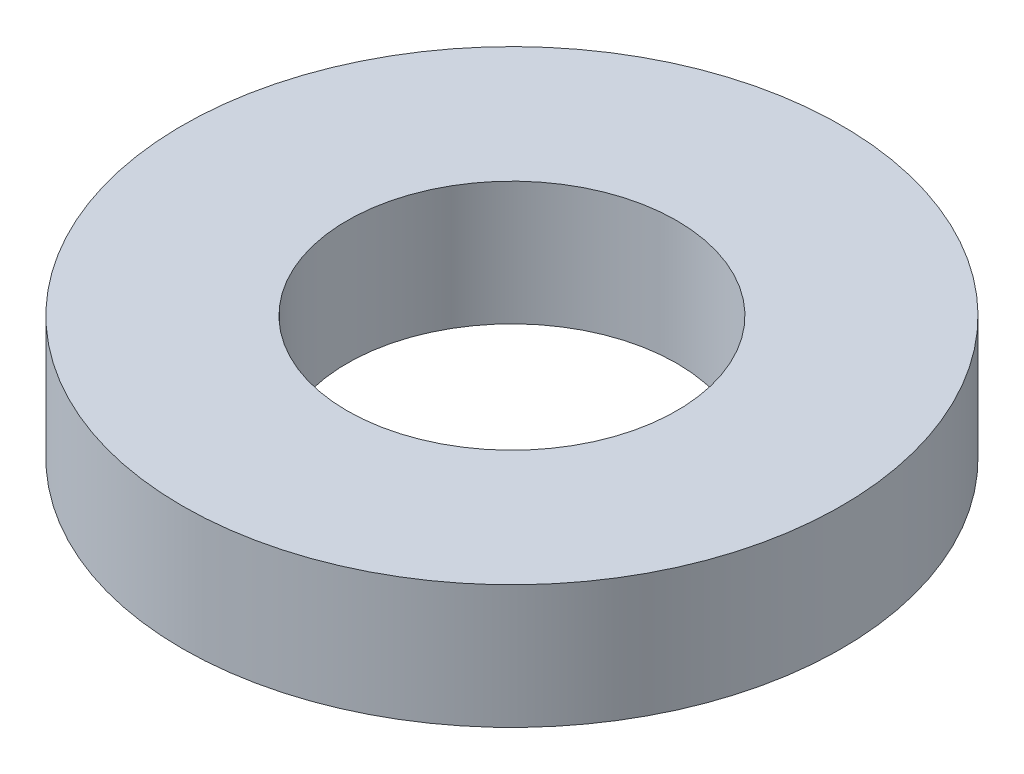
ISO-10303-21;
HEADER;
FILE_DESCRIPTION(('STEP AP214'),'2;1');
FILE_NAME('part.step','',(''),(''),'','','');
FILE_SCHEMA(('AUTOMOTIVE_DESIGN { 1 0 10303 214 1 1 1 1 }'));
ENDSEC;
DATA;
#1=APPLICATION_CONTEXT('core data for automotive mechanical design processes');
#2=APPLICATION_PROTOCOL_DEFINITION('international standard','automotive_design',2000,#1);
#3=PRODUCT_CONTEXT('',#1,'mechanical');
#4=PRODUCT('Part','Part','',(#3));
#5=PRODUCT_RELATED_PRODUCT_CATEGORY('part','',(#4));
#6=PRODUCT_DEFINITION_FORMATION('','',#4);
#7=PRODUCT_DEFINITION_CONTEXT('part definition',#1,'design');
#8=PRODUCT_DEFINITION('design','',#6,#7);
#9=PRODUCT_DEFINITION_SHAPE('','',#8);
#10=(LENGTH_UNIT() NAMED_UNIT(*) SI_UNIT(.MILLI.,.METRE.));
#11=(NAMED_UNIT(*) PLANE_ANGLE_UNIT() SI_UNIT($,.RADIAN.));
#12=(NAMED_UNIT(*) SI_UNIT($,.STERADIAN.) SOLID_ANGLE_UNIT());
#13=UNCERTAINTY_MEASURE_WITH_UNIT(LENGTH_MEASURE(1.E-05),#10,'distance_accuracy_value','');
#14=(GEOMETRIC_REPRESENTATION_CONTEXT(3) GLOBAL_UNCERTAINTY_ASSIGNED_CONTEXT((#13)) GLOBAL_UNIT_ASSIGNED_CONTEXT((#10,
#11,#12)) REPRESENTATION_CONTEXT('',''));
#15=CARTESIAN_POINT('',(0.,0.,0.));
#16=DIRECTION('',(0.,0.,1.));
#17=DIRECTION('',(1.,0.,0.));
#18=AXIS2_PLACEMENT_3D('',#15,#16,#17);
#19=CARTESIAN_POINT('',(0.,15.,0.));
#20=DIRECTION('',(0.,-1.,0.));
#21=DIRECTION('',(0.,0.,-1.));
#22=AXIS2_PLACEMENT_3D('',#19,#20,#21);
#23=CYLINDRICAL_SURFACE('',#22,40.);
#24=CARTESIAN_POINT('',(0.,15.,0.));
#25=DIRECTION('',(0.,1.,0.));
#26=DIRECTION('',(0.,0.,1.));
#27=AXIS2_PLACEMENT_3D('',#24,#25,#26);
#28=CIRCLE('',#27,40.);
#29=CARTESIAN_POINT('',(0.,15.,40.));
#30=VERTEX_POINT('',#29);
#31=EDGE_CURVE('E10',#30,#30,#28,.T.);
#32=ORIENTED_EDGE('',*,*,#31,.F.);
#33=EDGE_LOOP('',(#32));
#34=FACE_BOUND('',#33,.T.);
#35=CARTESIAN_POINT('',(0.,0.,0.));
#36=DIRECTION('',(0.,1.,0.));
#37=DIRECTION('',(0.,0.,1.));
#38=AXIS2_PLACEMENT_3D('',#35,#36,#37);
#39=CIRCLE('',#38,40.);
#40=CARTESIAN_POINT('',(0.,0.,40.));
#41=VERTEX_POINT('',#40);
#42=EDGE_CURVE('E37',#41,#41,#39,.T.);
#43=ORIENTED_EDGE('',*,*,#42,.T.);
#44=EDGE_LOOP('',(#43));
#45=FACE_BOUND('',#44,.T.);
#46=ADVANCED_FACE('F40',(#34,#45),#23,.T.);
#47=CARTESIAN_POINT('',(0.,15.,0.));
#48=DIRECTION('',(0.,1.,0.));
#49=DIRECTION('',(0.,0.,1.));
#50=AXIS2_PLACEMENT_3D('',#47,#48,#49);
#51=PLANE('',#50);
#52=CARTESIAN_POINT('',(0.,15.,0.));
#53=DIRECTION('',(0.,1.,0.));
#54=DIRECTION('',(0.,0.,1.));
#55=AXIS2_PLACEMENT_3D('',#52,#53,#54);
#56=CIRCLE('',#55,20.);
#57=CARTESIAN_POINT('',(0.,15.,20.));
#58=VERTEX_POINT('',#57);
#59=EDGE_CURVE('E50',#58,#58,#56,.T.);
#60=ORIENTED_EDGE('',*,*,#59,.F.);
#61=EDGE_LOOP('',(#60));
#62=FACE_BOUND('',#61,.T.);
#63=ORIENTED_EDGE('',*,*,#31,.T.);
#64=EDGE_LOOP('',(#63));
#65=FACE_BOUND('',#64,.T.);
#66=ADVANCED_FACE('F59',(#62,#65),#51,.T.);
#67=CARTESIAN_POINT('',(0.,0.,0.));
#68=DIRECTION('',(0.,1.,0.));
#69=DIRECTION('',(0.,0.,1.));
#70=AXIS2_PLACEMENT_3D('',#67,#68,#69);
#71=PLANE('',#70);
#72=CARTESIAN_POINT('',(0.,0.,0.));
#73=DIRECTION('',(0.,1.,0.));
#74=DIRECTION('',(0.,0.,1.));
#75=AXIS2_PLACEMENT_3D('',#72,#73,#74);
#76=CIRCLE('',#75,20.);
#77=CARTESIAN_POINT('',(0.,0.,20.));
#78=VERTEX_POINT('',#77);
#79=EDGE_CURVE('E47',#78,#78,#76,.T.);
#80=ORIENTED_EDGE('',*,*,#79,.T.);
#81=EDGE_LOOP('',(#80));
#82=FACE_BOUND('',#81,.T.);
#83=ORIENTED_EDGE('',*,*,#42,.F.);
#84=EDGE_LOOP('',(#83));
#85=FACE_BOUND('',#84,.T.);
#86=ADVANCED_FACE('F58',(#82,#85),#71,.F.);
#87=CARTESIAN_POINT('',(0.,15.,0.));
#88=DIRECTION('',(0.,-1.,0.));
#89=DIRECTION('',(0.,0.,-1.));
#90=AXIS2_PLACEMENT_3D('',#87,#88,#89);
#91=CYLINDRICAL_SURFACE('',#90,20.);
#92=ORIENTED_EDGE('',*,*,#59,.T.);
#93=EDGE_LOOP('',(#92));
#94=FACE_BOUND('',#93,.T.);
#95=ORIENTED_EDGE('',*,*,#79,.F.);
#96=EDGE_LOOP('',(#95));
#97=FACE_BOUND('',#96,.T.);
#98=ADVANCED_FACE('F54',(#94,#97),#91,.F.);
#99=CLOSED_SHELL('',(#46,#66,#86,#98));
#100=MANIFOLD_SOLID_BREP('B2',#99);
#101=ADVANCED_BREP_SHAPE_REPRESENTATION('',(#18,#100),#14);
#102=SHAPE_DEFINITION_REPRESENTATION(#9,#101);
ENDSEC;
END-ISO-10303-21;
